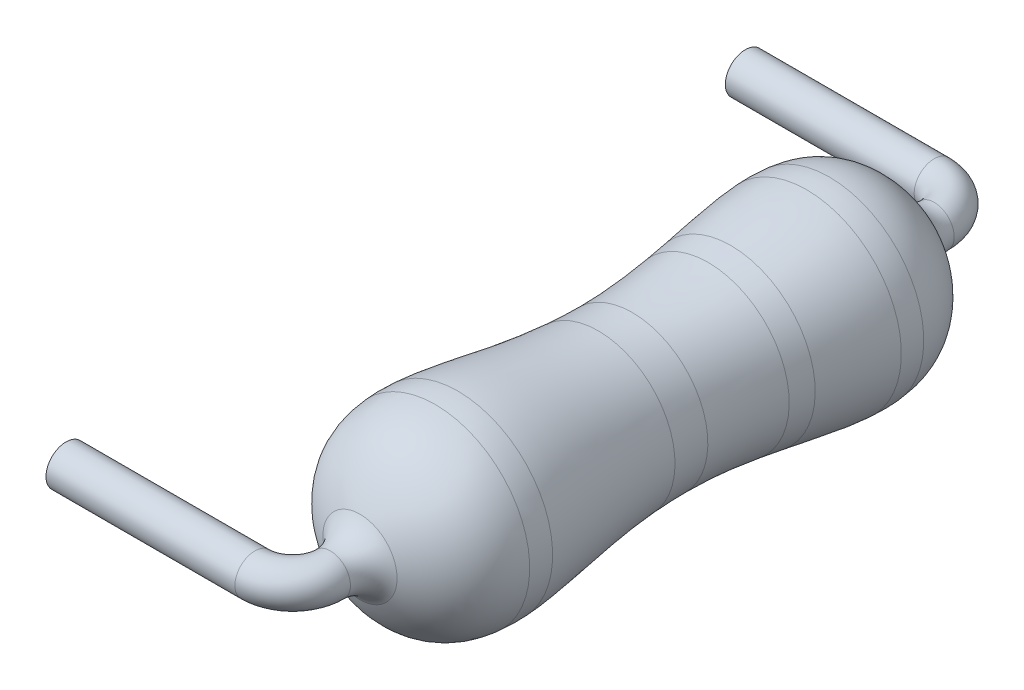
ISO-10303-21;
HEADER;
FILE_DESCRIPTION(('STEP AP214'),'2;1');
FILE_NAME('part.step','',(''),(''),'','','');
FILE_SCHEMA(('AUTOMOTIVE_DESIGN { 1 0 10303 214 1 1 1 1 }'));
ENDSEC;
DATA;
#1=APPLICATION_CONTEXT('core data for automotive mechanical design processes');
#2=APPLICATION_PROTOCOL_DEFINITION('international standard','automotive_design',2000,#1);
#3=PRODUCT_CONTEXT('',#1,'mechanical');
#4=PRODUCT('Part','Part','',(#3));
#5=PRODUCT_RELATED_PRODUCT_CATEGORY('part','',(#4));
#6=PRODUCT_DEFINITION_FORMATION('','',#4);
#7=PRODUCT_DEFINITION_CONTEXT('part definition',#1,'design');
#8=PRODUCT_DEFINITION('design','',#6,#7);
#9=PRODUCT_DEFINITION_SHAPE('','',#8);
#10=(LENGTH_UNIT() NAMED_UNIT(*) SI_UNIT(.MILLI.,.METRE.));
#11=(NAMED_UNIT(*) PLANE_ANGLE_UNIT() SI_UNIT($,.RADIAN.));
#12=(NAMED_UNIT(*) SI_UNIT($,.STERADIAN.) SOLID_ANGLE_UNIT());
#13=UNCERTAINTY_MEASURE_WITH_UNIT(LENGTH_MEASURE(1.E-05),#10,'distance_accuracy_value','');
#14=(GEOMETRIC_REPRESENTATION_CONTEXT(3) GLOBAL_UNCERTAINTY_ASSIGNED_CONTEXT((#13)) GLOBAL_UNIT_ASSIGNED_CONTEXT((#10,
#11,#12)) REPRESENTATION_CONTEXT('',''));
#15=CARTESIAN_POINT('',(0.,0.,0.));
#16=DIRECTION('',(0.,0.,1.));
#17=DIRECTION('',(1.,0.,0.));
#18=AXIS2_PLACEMENT_3D('',#15,#16,#17);
#19=CARTESIAN_POINT('',(-3.,0.,4.49625000000022));
#20=DIRECTION('',(-1.,0.,0.));
#21=DIRECTION('',(0.,0.,1.));
#22=AXIS2_PLACEMENT_3D('',#19,#20,#21);
#23=PLANE('',#22);
#24=CARTESIAN_POINT('',(-3.,0.,4.49625000000022));
#25=DIRECTION('',(-1.,0.,0.));
#26=DIRECTION('',(0.,0.,1.));
#27=AXIS2_PLACEMENT_3D('',#24,#25,#26);
#28=CIRCLE('',#27,0.265);
#29=CARTESIAN_POINT('',(-3.,0.,4.76125000000023));
#30=VERTEX_POINT('',#29);
#31=EDGE_CURVE('E10',#30,#30,#28,.T.);
#32=ORIENTED_EDGE('',*,*,#31,.T.);
#33=EDGE_LOOP('',(#32));
#34=FACE_BOUND('',#33,.T.);
#35=ADVANCED_FACE('F43',(#34),#23,.T.);
#36=CARTESIAN_POINT('',(-0.499999999999999,0.,3.99625000000023));
#37=DIRECTION('',(0.,-1.,0.));
#38=DIRECTION('',(0.,0.,-1.));
#39=AXIS2_PLACEMENT_3D('',#36,#37,#38);
#40=TOROIDAL_SURFACE('',#39,0.499999999999999,0.265);
#41=CARTESIAN_POINT('',(0.,0.,3.99625000000023));
#42=DIRECTION('',(0.,0.,1.));
#43=DIRECTION('',(1.,0.,0.));
#44=AXIS2_PLACEMENT_3D('',#41,#42,#43);
#45=CIRCLE('',#44,0.265);
#46=CARTESIAN_POINT('',(0.265,0.,3.99625000000023));
#47=VERTEX_POINT('',#46);
#48=EDGE_CURVE('E47',#47,#47,#45,.T.);
#49=CARTESIAN_POINT('',(-0.499999999999999,0.,4.49625000000022));
#50=DIRECTION('',(-1.,0.,0.));
#51=DIRECTION('',(0.,0.,1.));
#52=AXIS2_PLACEMENT_3D('',#49,#50,#51);
#53=CIRCLE('',#52,0.265);
#54=CARTESIAN_POINT('',(-0.499999999999999,0.,4.76125000000022));
#55=VERTEX_POINT('',#54);
#56=EDGE_CURVE('E52',#55,#55,#53,.T.);
#57=CARTESIAN_POINT('',(-0.499999999999999,0.,3.99625000000023));
#58=DIRECTION('',(0.,-1.,0.));
#59=DIRECTION('',(0.,0.,-1.));
#60=AXIS2_PLACEMENT_3D('',#57,#58,#59);
#61=CIRCLE('',#60,0.764999999999999);
#62=EDGE_CURVE('',#47,#55,#61,.T.);
#63=ORIENTED_EDGE('',*,*,#48,.T.);
#64=ORIENTED_EDGE('',*,*,#56,.F.);
#65=ORIENTED_EDGE('',*,*,#62,.T.);
#66=ORIENTED_EDGE('',*,*,#62,.F.);
#67=EDGE_LOOP('',(#63,#65,#64,#66));
#68=FACE_BOUND('',#67,.T.);
#69=ADVANCED_FACE('F137',(#68),#40,.T.);
#70=CARTESIAN_POINT('',(-0.499999999999999,0.,4.49625000000022));
#71=DIRECTION('',(-1.,0.,0.));
#72=DIRECTION('',(0.,0.,1.));
#73=AXIS2_PLACEMENT_3D('',#70,#71,#72);
#74=CYLINDRICAL_SURFACE('',#73,0.265);
#75=ORIENTED_EDGE('',*,*,#31,.F.);
#76=EDGE_LOOP('',(#75));
#77=FACE_BOUND('',#76,.T.);
#78=ORIENTED_EDGE('',*,*,#56,.T.);
#79=EDGE_LOOP('',(#78));
#80=FACE_BOUND('',#79,.T.);
#81=ADVANCED_FACE('F140',(#77,#80),#74,.T.);
#82=CARTESIAN_POINT('',(0.,0.265,-3.69812499999977));
#83=CARTESIAN_POINT('',(0.,3.25925769484755,-2.60830432535273));
#84=CARTESIAN_POINT('',(0.,-1.76734359313006,2.25496928955296E-13));
#85=CARTESIAN_POINT('',(0.,3.25925769484755,2.60830432535318));
#86=CARTESIAN_POINT('',(0.,0.265,3.69812500000023));
#87=B_SPLINE_CURVE_WITH_KNOTS('',4,(#82,#83,#84,#85,#86),.UNSPECIFIED.,.F.,.F.,(5,5),(0.,1.),.UNSPECIFIED.);
#88=CARTESIAN_POINT('',(0.,0.,-3.39999999999977));
#89=DIRECTION('',(0.,0.,-1.));
#90=AXIS1_PLACEMENT('',#88,#89);
#91=SURFACE_OF_REVOLUTION('',#87,#90);
#92=CARTESIAN_POINT('',(0.,0.,-1.30415216267636));
#93=DIRECTION('',(0.,0.,-1.));
#94=DIRECTION('',(0.,1.,0.));
#95=AXIS2_PLACEMENT_3D('',#92,#93,#94);
#96=CIRCLE('',#95,1.11690653960701);
#97=CARTESIAN_POINT('',(0.,1.11690653960701,-1.30415216267636));
#98=VERTEX_POINT('',#97);
#99=EDGE_CURVE('E81',#98,#98,#96,.F.);
#100=ORIENTED_EDGE('',*,*,#99,.T.);
#101=EDGE_LOOP('',(#100));
#102=FACE_BOUND('',#101,.T.);
#103=CARTESIAN_POINT('',(0.,0.,-1.00415216267636));
#104=DIRECTION('',(0.,0.,-1.));
#105=DIRECTION('',(0.,1.,0.));
#106=AXIS2_PLACEMENT_3D('',#103,#104,#105);
#107=CIRCLE('',#106,1.07270825035506);
#108=CARTESIAN_POINT('',(0.,1.07270825035506,-1.00415216267636));
#109=VERTEX_POINT('',#108);
#110=EDGE_CURVE('E75',#109,#109,#107,.T.);
#111=ORIENTED_EDGE('',*,*,#110,.T.);
#112=EDGE_LOOP('',(#111));
#113=FACE_BOUND('',#112,.T.);
#114=ADVANCED_FACE('F125',(#102,#113),#91,.F.);
#115=ORIENTED_EDGE('',*,*,#110,.F.);
#116=EDGE_LOOP('',(#115));
#117=FACE_BOUND('',#116,.T.);
#118=CARTESIAN_POINT('',(0.,0.,0.));
#119=DIRECTION('',(0.,0.,-1.));
#120=DIRECTION('',(0.,1.,0.));
#121=AXIS2_PLACEMENT_3D('',#118,#119,#120);
#122=CIRCLE('',#121,1.);
#123=CARTESIAN_POINT('',(0.,1.,0.));
#124=VERTEX_POINT('',#123);
#125=EDGE_CURVE('E93',#124,#124,#122,.T.);
#126=ORIENTED_EDGE('',*,*,#125,.T.);
#127=EDGE_LOOP('',(#126));
#128=FACE_BOUND('',#127,.T.);
#129=ADVANCED_FACE('F148',(#117,#128),#91,.F.);
#130=CARTESIAN_POINT('',(0.,0.,-2.60830432535273));
#131=DIRECTION('',(0.,0.,-1.));
#132=DIRECTION('',(0.,1.,0.));
#133=AXIS2_PLACEMENT_3D('',#130,#131,#132);
#134=CIRCLE('',#133,1.25);
#135=CARTESIAN_POINT('',(0.,1.25,-2.60830432535273));
#136=VERTEX_POINT('',#135);
#137=EDGE_CURVE('E89',#136,#136,#134,.F.);
#138=ORIENTED_EDGE('',*,*,#137,.T.);
#139=EDGE_LOOP('',(#138));
#140=FACE_BOUND('',#139,.T.);
#141=CARTESIAN_POINT('',(0.,0.,-2.30830432535273));
#142=DIRECTION('',(0.,0.,-1.));
#143=DIRECTION('',(0.,1.,0.));
#144=AXIS2_PLACEMENT_3D('',#141,#142,#143);
#145=CIRCLE('',#144,1.25352368885137);
#146=CARTESIAN_POINT('',(0.,1.25352368885137,-2.30830432535273));
#147=VERTEX_POINT('',#146);
#148=EDGE_CURVE('E85',#147,#147,#145,.T.);
#149=ORIENTED_EDGE('',*,*,#148,.T.);
#150=EDGE_LOOP('',(#149));
#151=FACE_BOUND('',#150,.T.);
#152=ADVANCED_FACE('F153',(#140,#151),#91,.F.);
#153=ORIENTED_EDGE('',*,*,#99,.F.);
#154=EDGE_LOOP('',(#153));
#155=FACE_BOUND('',#154,.T.);
#156=ORIENTED_EDGE('',*,*,#148,.F.);
#157=EDGE_LOOP('',(#156));
#158=FACE_BOUND('',#157,.T.);
#159=ADVANCED_FACE('F175',(#155,#158),#91,.F.);
#160=ORIENTED_EDGE('',*,*,#137,.F.);
#161=EDGE_LOOP('',(#160));
#162=FACE_BOUND('',#161,.T.);
#163=CARTESIAN_POINT('',(0.,0.,-3.60499792110642));
#164=DIRECTION('',(0.,0.,1.));
#165=DIRECTION('',(1.,0.,0.));
#166=AXIS2_PLACEMENT_3D('',#163,#164,#165);
#167=CIRCLE('',#166,0.490889493070077);
#168=CARTESIAN_POINT('',(0.490889493070077,0.,-3.60499792110642));
#169=VERTEX_POINT('',#168);
#170=EDGE_CURVE('E109',#169,#169,#167,.T.);
#171=ORIENTED_EDGE('',*,*,#170,.T.);
#172=EDGE_LOOP('',(#171));
#173=FACE_BOUND('',#172,.T.);
#174=ADVANCED_FACE('F168',(#162,#173),#91,.F.);
#175=CARTESIAN_POINT('',(0.,0.,2.30830432535318));
#176=DIRECTION('',(0.,0.,-1.));
#177=DIRECTION('',(0.,1.,0.));
#178=AXIS2_PLACEMENT_3D('',#175,#176,#177);
#179=CIRCLE('',#178,1.25352368885137);
#180=CARTESIAN_POINT('',(0.,1.25352368885137,2.30830432535318));
#181=VERTEX_POINT('',#180);
#182=EDGE_CURVE('E105',#181,#181,#179,.T.);
#183=ORIENTED_EDGE('',*,*,#182,.T.);
#184=EDGE_LOOP('',(#183));
#185=FACE_BOUND('',#184,.T.);
#186=CARTESIAN_POINT('',(0.,0.,0.450000000000003));
#187=DIRECTION('',(0.,0.,-1.));
#188=DIRECTION('',(0.,1.,0.));
#189=AXIS2_PLACEMENT_3D('',#186,#187,#188);
#190=CIRCLE('',#189,1.01535348671816);
#191=CARTESIAN_POINT('',(0.,1.01535348671816,0.450000000000003));
#192=VERTEX_POINT('',#191);
#193=EDGE_CURVE('E97',#192,#192,#190,.F.);
#194=ORIENTED_EDGE('',*,*,#193,.T.);
#195=EDGE_LOOP('',(#194));
#196=FACE_BOUND('',#195,.T.);
#197=ADVANCED_FACE('F166',(#185,#196),#91,.F.);
#198=CARTESIAN_POINT('',(0.,0.,3.60499792110688));
#199=DIRECTION('',(0.,0.,1.));
#200=DIRECTION('',(1.,0.,0.));
#201=AXIS2_PLACEMENT_3D('',#198,#199,#200);
#202=CIRCLE('',#201,0.490889493070076);
#203=CARTESIAN_POINT('',(0.490889493070076,0.,3.60499792110688));
#204=VERTEX_POINT('',#203);
#205=EDGE_CURVE('E189',#204,#204,#202,.T.);
#206=ORIENTED_EDGE('',*,*,#205,.F.);
#207=EDGE_LOOP('',(#206));
#208=FACE_BOUND('',#207,.T.);
#209=CARTESIAN_POINT('',(0.,0.,2.60830432535318));
#210=DIRECTION('',(0.,0.,-1.));
#211=DIRECTION('',(0.,1.,0.));
#212=AXIS2_PLACEMENT_3D('',#209,#210,#211);
#213=CIRCLE('',#212,1.25);
#214=CARTESIAN_POINT('',(0.,1.25,2.60830432535318));
#215=VERTEX_POINT('',#214);
#216=EDGE_CURVE('E101',#215,#215,#213,.F.);
#217=ORIENTED_EDGE('',*,*,#216,.T.);
#218=EDGE_LOOP('',(#217));
#219=FACE_BOUND('',#218,.T.);
#220=ADVANCED_FACE('F163',(#208,#219),#91,.F.);
#221=ORIENTED_EDGE('',*,*,#125,.F.);
#222=EDGE_LOOP('',(#221));
#223=FACE_BOUND('',#222,.T.);
#224=ORIENTED_EDGE('',*,*,#193,.F.);
#225=EDGE_LOOP('',(#224));
#226=FACE_BOUND('',#225,.T.);
#227=ADVANCED_FACE('F126',(#223,#226),#91,.F.);
#228=CARTESIAN_POINT('',(0.,0.,3.99625000000023));
#229=DIRECTION('',(0.,0.,1.));
#230=DIRECTION('',(1.,0.,0.));
#231=AXIS2_PLACEMENT_3D('',#228,#229,#230);
#232=TOROIDAL_SURFACE('',#231,0.71677898614015,0.451778986140151);
#233=ORIENTED_EDGE('',*,*,#48,.F.);
#234=EDGE_LOOP('',(#233));
#235=FACE_BOUND('',#234,.T.);
#236=ORIENTED_EDGE('',*,*,#205,.T.);
#237=EDGE_LOOP('',(#236));
#238=FACE_BOUND('',#237,.T.);
#239=ADVANCED_FACE('F127',(#235,#238),#232,.F.);
#240=CARTESIAN_POINT('',(0.,0.,-3.99624999999977));
#241=DIRECTION('',(0.,0.,1.));
#242=DIRECTION('',(1.,0.,0.));
#243=AXIS2_PLACEMENT_3D('',#240,#241,#242);
#244=TOROIDAL_SURFACE('',#243,0.716778986140151,0.451778986140151);
#245=ORIENTED_EDGE('',*,*,#170,.F.);
#246=EDGE_LOOP('',(#245));
#247=FACE_BOUND('',#246,.T.);
#248=CARTESIAN_POINT('',(0.,0.,-3.99624999999977));
#249=DIRECTION('',(0.,0.,1.));
#250=DIRECTION('',(1.,0.,0.));
#251=AXIS2_PLACEMENT_3D('',#248,#249,#250);
#252=CIRCLE('',#251,0.265);
#253=CARTESIAN_POINT('',(0.265,0.,-3.99624999999977));
#254=VERTEX_POINT('',#253);
#255=EDGE_CURVE('E60',#254,#254,#252,.T.);
#256=ORIENTED_EDGE('',*,*,#255,.T.);
#257=EDGE_LOOP('',(#256));
#258=FACE_BOUND('',#257,.T.);
#259=ADVANCED_FACE('F123',(#247,#258),#244,.F.);
#260=ORIENTED_EDGE('',*,*,#216,.F.);
#261=EDGE_LOOP('',(#260));
#262=FACE_BOUND('',#261,.T.);
#263=ORIENTED_EDGE('',*,*,#182,.F.);
#264=EDGE_LOOP('',(#263));
#265=FACE_BOUND('',#264,.T.);
#266=ADVANCED_FACE('F119',(#262,#265),#91,.F.);
#267=CARTESIAN_POINT('',(-3.,0.,-4.49624999999977));
#268=DIRECTION('',(1.,0.,0.));
#269=DIRECTION('',(0.,0.,-1.));
#270=AXIS2_PLACEMENT_3D('',#267,#268,#269);
#271=PLANE('',#270);
#272=CARTESIAN_POINT('',(-3.,0.,-4.49624999999977));
#273=DIRECTION('',(1.,0.,0.));
#274=DIRECTION('',(0.,0.,-1.));
#275=AXIS2_PLACEMENT_3D('',#272,#273,#274);
#276=CIRCLE('',#275,0.265);
#277=CARTESIAN_POINT('',(-3.,0.,-4.76124999999977));
#278=VERTEX_POINT('',#277);
#279=EDGE_CURVE('E70',#278,#278,#276,.T.);
#280=ORIENTED_EDGE('',*,*,#279,.F.);
#281=EDGE_LOOP('',(#280));
#282=FACE_BOUND('',#281,.T.);
#283=ADVANCED_FACE('F45',(#282),#271,.F.);
#284=CARTESIAN_POINT('',(-3.,0.,-4.49624999999977));
#285=DIRECTION('',(1.,0.,0.));
#286=DIRECTION('',(0.,0.,-1.));
#287=AXIS2_PLACEMENT_3D('',#284,#285,#286);
#288=CYLINDRICAL_SURFACE('',#287,0.265);
#289=CARTESIAN_POINT('',(-0.5,0.,-4.49624999999978));
#290=DIRECTION('',(1.,0.,0.));
#291=DIRECTION('',(0.,0.,-1.));
#292=AXIS2_PLACEMENT_3D('',#289,#290,#291);
#293=CIRCLE('',#292,0.265);
#294=CARTESIAN_POINT('',(-0.5,0.,-4.76124999999977));
#295=VERTEX_POINT('',#294);
#296=EDGE_CURVE('E63',#295,#295,#293,.T.);
#297=ORIENTED_EDGE('',*,*,#296,.F.);
#298=EDGE_LOOP('',(#297));
#299=FACE_BOUND('',#298,.T.);
#300=ORIENTED_EDGE('',*,*,#279,.T.);
#301=EDGE_LOOP('',(#300));
#302=FACE_BOUND('',#301,.T.);
#303=ADVANCED_FACE('F129',(#299,#302),#288,.T.);
#304=CARTESIAN_POINT('',(-0.5,0.,-3.99624999999977));
#305=DIRECTION('',(0.,-1.,0.));
#306=DIRECTION('',(0.,0.,-1.));
#307=AXIS2_PLACEMENT_3D('',#304,#305,#306);
#308=TOROIDAL_SURFACE('',#307,0.5,0.265);
#309=CARTESIAN_POINT('',(-0.5,0.,-3.99624999999977));
#310=DIRECTION('',(0.,-1.,0.));
#311=DIRECTION('',(0.,0.,-1.));
#312=AXIS2_PLACEMENT_3D('',#309,#310,#311);
#313=CIRCLE('',#312,0.765);
#314=EDGE_CURVE('',#295,#254,#313,.T.);
#315=ORIENTED_EDGE('',*,*,#296,.T.);
#316=ORIENTED_EDGE('',*,*,#255,.F.);
#317=ORIENTED_EDGE('',*,*,#314,.T.);
#318=ORIENTED_EDGE('',*,*,#314,.F.);
#319=EDGE_LOOP('',(#315,#317,#316,#318));
#320=FACE_BOUND('',#319,.T.);
#321=ADVANCED_FACE('F132',(#320),#308,.T.);
#322=CLOSED_SHELL('',(#35,#69,#81,#114,#129,#152,#159,#174,#197,#220,#227,#239,#259,#266,#283,
#303,#321));
#323=MANIFOLD_SOLID_BREP('B2',#322);
#324=ADVANCED_BREP_SHAPE_REPRESENTATION('',(#18,#323),#14);
#325=SHAPE_DEFINITION_REPRESENTATION(#9,#324);
ENDSEC;
END-ISO-10303-21;
